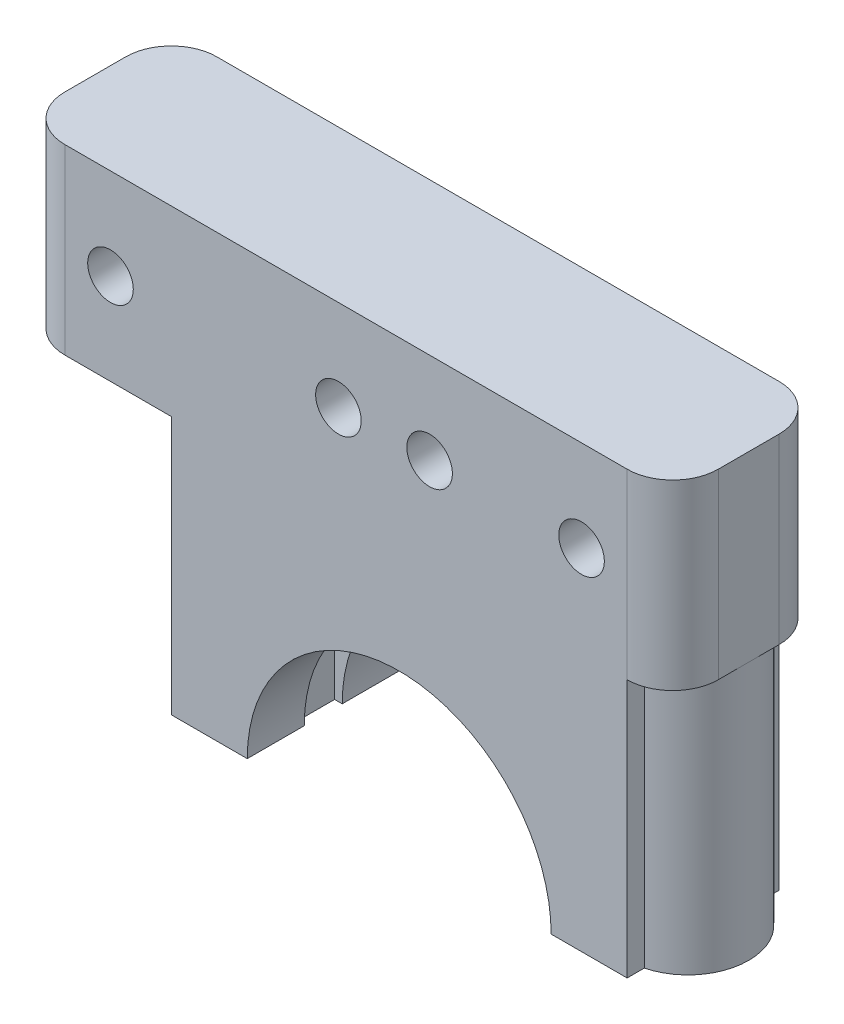
ISO-10303-21;
HEADER;
FILE_DESCRIPTION(('STEP AP214'),'2;1');
FILE_NAME('part.step','',(''),(''),'','','');
FILE_SCHEMA(('AUTOMOTIVE_DESIGN { 1 0 10303 214 1 1 1 1 }'));
ENDSEC;
DATA;
#1=APPLICATION_CONTEXT('core data for automotive mechanical design processes');
#2=APPLICATION_PROTOCOL_DEFINITION('international standard','automotive_design',2000,#1);
#3=PRODUCT_CONTEXT('',#1,'mechanical');
#4=PRODUCT('Part','Part','',(#3));
#5=PRODUCT_RELATED_PRODUCT_CATEGORY('part','',(#4));
#6=PRODUCT_DEFINITION_FORMATION('','',#4);
#7=PRODUCT_DEFINITION_CONTEXT('part definition',#1,'design');
#8=PRODUCT_DEFINITION('design','',#6,#7);
#9=PRODUCT_DEFINITION_SHAPE('','',#8);
#10=(LENGTH_UNIT() NAMED_UNIT(*) SI_UNIT(.MILLI.,.METRE.));
#11=(NAMED_UNIT(*) PLANE_ANGLE_UNIT() SI_UNIT($,.RADIAN.));
#12=(NAMED_UNIT(*) SI_UNIT($,.STERADIAN.) SOLID_ANGLE_UNIT());
#13=UNCERTAINTY_MEASURE_WITH_UNIT(LENGTH_MEASURE(1.E-05),#10,'distance_accuracy_value','');
#14=(GEOMETRIC_REPRESENTATION_CONTEXT(3) GLOBAL_UNCERTAINTY_ASSIGNED_CONTEXT((#13)) GLOBAL_UNIT_ASSIGNED_CONTEXT((#10,
#11,#12)) REPRESENTATION_CONTEXT('',''));
#15=CARTESIAN_POINT('',(0.,0.,0.));
#16=DIRECTION('',(0.,0.,1.));
#17=DIRECTION('',(1.,0.,0.));
#18=AXIS2_PLACEMENT_3D('',#15,#16,#17);
#19=CARTESIAN_POINT('',(-15.,22.8309518948453,0.));
#20=DIRECTION('',(-1.,0.,0.));
#21=DIRECTION('',(0.,0.,1.));
#22=AXIS2_PLACEMENT_3D('',#19,#20,#21);
#23=PLANE('',#22);
#24=DIRECTION('',(0.,-1.,0.));
#25=VECTOR('',#24,1.);
#26=CARTESIAN_POINT('',(-15.,22.8309518948453,1.12701665379258));
#27=LINE('',#26,#25);
#28=CARTESIAN_POINT('',(-15.,17.,1.12701665379258));
#29=VERTEX_POINT('',#28);
#30=CARTESIAN_POINT('',(-15.,0.,1.12701665379258));
#31=VERTEX_POINT('',#30);
#32=EDGE_CURVE('E208',#29,#31,#27,.T.);
#33=ORIENTED_EDGE('',*,*,#32,.F.);
#34=DIRECTION('',(0.,0.,-1.));
#35=VECTOR('',#34,1.);
#36=CARTESIAN_POINT('',(-15.,17.,0.));
#37=LINE('',#36,#35);
#38=CARTESIAN_POINT('',(-15.,17.,0.));
#39=VERTEX_POINT('',#38);
#40=EDGE_CURVE('E193',#29,#39,#37,.T.);
#41=ORIENTED_EDGE('',*,*,#40,.T.);
#42=DIRECTION('',(0.,-1.,0.));
#43=VECTOR('',#42,1.);
#44=CARTESIAN_POINT('',(-15.,22.8309518948453,0.));
#45=LINE('',#44,#43);
#46=CARTESIAN_POINT('',(-15.,0.,0.));
#47=VERTEX_POINT('',#46);
#48=EDGE_CURVE('E206',#39,#47,#45,.T.);
#49=ORIENTED_EDGE('',*,*,#48,.T.);
#50=DIRECTION('',(0.,0.,-1.));
#51=VECTOR('',#50,1.);
#52=CARTESIAN_POINT('',(-15.,0.,0.));
#53=LINE('',#52,#51);
#54=EDGE_CURVE('E273',#31,#47,#53,.T.);
#55=ORIENTED_EDGE('',*,*,#54,.F.);
#56=EDGE_LOOP('',(#33,#41,#49,#55));
#57=FACE_BOUND('',#56,.T.);
#58=ADVANCED_FACE('F34',(#57),#23,.T.);
#59=CARTESIAN_POINT('',(14.,22.8309518948453,5.00000000000001));
#60=DIRECTION('',(0.,-1.,0.));
#61=DIRECTION('',(0.,0.,-1.));
#62=AXIS2_PLACEMENT_3D('',#59,#60,#61);
#63=CYLINDRICAL_SURFACE('',#62,4.);
#64=CARTESIAN_POINT('',(14.,17.,5.00000000000001));
#65=DIRECTION('',(0.,1.,0.));
#66=DIRECTION('',(-1.,0.,0.));
#67=AXIS2_PLACEMENT_3D('',#64,#65,#66);
#68=CIRCLE('',#67,4.);
#69=CARTESIAN_POINT('',(18.,17.,5.00000000000001));
#70=VERTEX_POINT('',#69);
#71=CARTESIAN_POINT('',(15.,17.,1.12701665379259));
#72=VERTEX_POINT('',#71);
#73=EDGE_CURVE('E364',#70,#72,#68,.T.);
#74=ORIENTED_EDGE('',*,*,#73,.F.);
#75=CARTESIAN_POINT('',(15.,17.,8.87298334620743));
#76=VERTEX_POINT('',#75);
#77=EDGE_CURVE('E361',#76,#70,#68,.T.);
#78=ORIENTED_EDGE('',*,*,#77,.F.);
#79=DIRECTION('',(0.,-1.,0.));
#80=VECTOR('',#79,1.);
#81=CARTESIAN_POINT('',(15.,22.8309518948453,8.87298334620743));
#82=LINE('',#81,#80);
#83=CARTESIAN_POINT('',(15.,0.,8.87298334620743));
#84=VERTEX_POINT('',#83);
#85=EDGE_CURVE('E232',#76,#84,#82,.T.);
#86=ORIENTED_EDGE('',*,*,#85,.T.);
#87=CARTESIAN_POINT('',(14.,0.,5.00000000000001));
#88=DIRECTION('',(0.,1.,0.));
#89=DIRECTION('',(0.,0.,1.));
#90=AXIS2_PLACEMENT_3D('',#87,#88,#89);
#91=CIRCLE('',#90,4.);
#92=CARTESIAN_POINT('',(15.,0.,1.12701665379259));
#93=VERTEX_POINT('',#92);
#94=EDGE_CURVE('E292',#84,#93,#91,.T.);
#95=ORIENTED_EDGE('',*,*,#94,.T.);
#96=DIRECTION('',(0.,-1.,0.));
#97=VECTOR('',#96,1.);
#98=CARTESIAN_POINT('',(15.,22.8309518948453,1.12701665379259));
#99=LINE('',#98,#97);
#100=EDGE_CURVE('E222',#72,#93,#99,.T.);
#101=ORIENTED_EDGE('',*,*,#100,.F.);
#102=EDGE_LOOP('',(#74,#78,#86,#95,#101));
#103=FACE_BOUND('',#102,.T.);
#104=ADVANCED_FACE('F438',(#103),#63,.T.);
#105=CARTESIAN_POINT('',(15.,22.8309518948453,0.));
#106=DIRECTION('',(-1.,0.,0.));
#107=DIRECTION('',(0.,0.,1.));
#108=AXIS2_PLACEMENT_3D('',#105,#106,#107);
#109=PLANE('',#108);
#110=DIRECTION('',(0.,0.,-1.));
#111=VECTOR('',#110,1.);
#112=CARTESIAN_POINT('',(15.,17.,0.));
#113=LINE('',#112,#111);
#114=CARTESIAN_POINT('',(15.,17.,0.));
#115=VERTEX_POINT('',#114);
#116=EDGE_CURVE('E365',#72,#115,#113,.T.);
#117=ORIENTED_EDGE('',*,*,#116,.F.);
#118=ORIENTED_EDGE('',*,*,#100,.T.);
#119=DIRECTION('',(0.,0.,-1.));
#120=VECTOR('',#119,1.);
#121=CARTESIAN_POINT('',(15.,0.,0.));
#122=LINE('',#121,#120);
#123=CARTESIAN_POINT('',(15.,0.,0.));
#124=VERTEX_POINT('',#123);
#125=EDGE_CURVE('E264',#93,#124,#122,.T.);
#126=ORIENTED_EDGE('',*,*,#125,.T.);
#127=DIRECTION('',(0.,-1.,0.));
#128=VECTOR('',#127,1.);
#129=CARTESIAN_POINT('',(15.,22.8309518948453,0.));
#130=LINE('',#129,#128);
#131=EDGE_CURVE('E218',#115,#124,#130,.T.);
#132=ORIENTED_EDGE('',*,*,#131,.F.);
#133=EDGE_LOOP('',(#117,#118,#126,#132));
#134=FACE_BOUND('',#133,.T.);
#135=ADVANCED_FACE('F443',(#134),#109,.F.);
#136=CARTESIAN_POINT('',(-14.,22.8309518948453,5.));
#137=DIRECTION('',(0.,-1.,0.));
#138=DIRECTION('',(0.,0.,-1.));
#139=AXIS2_PLACEMENT_3D('',#136,#137,#138);
#140=CYLINDRICAL_SURFACE('',#139,4.);
#141=DIRECTION('',(0.,-1.,0.));
#142=VECTOR('',#141,1.);
#143=CARTESIAN_POINT('',(-15.,22.8309518948453,8.87298334620742));
#144=LINE('',#143,#142);
#145=CARTESIAN_POINT('',(-15.,17.,8.87298334620742));
#146=VERTEX_POINT('',#145);
#147=CARTESIAN_POINT('',(-15.,0.,8.87298334620742));
#148=VERTEX_POINT('',#147);
#149=EDGE_CURVE('E401',#146,#148,#144,.T.);
#150=ORIENTED_EDGE('',*,*,#149,.F.);
#151=CARTESIAN_POINT('',(-14.,17.,5.));
#152=DIRECTION('',(0.,1.,0.));
#153=DIRECTION('',(-1.,0.,0.));
#154=AXIS2_PLACEMENT_3D('',#151,#152,#153);
#155=CIRCLE('',#154,4.);
#156=EDGE_CURVE('E210',#146,#29,#155,.F.);
#157=ORIENTED_EDGE('',*,*,#156,.T.);
#158=ORIENTED_EDGE('',*,*,#32,.T.);
#159=CARTESIAN_POINT('',(-14.,0.,5.));
#160=DIRECTION('',(0.,1.,0.));
#161=DIRECTION('',(0.,0.,1.));
#162=AXIS2_PLACEMENT_3D('',#159,#160,#161);
#163=CIRCLE('',#162,4.);
#164=EDGE_CURVE('E279',#148,#31,#163,.F.);
#165=ORIENTED_EDGE('',*,*,#164,.F.);
#166=EDGE_LOOP('',(#150,#157,#158,#165));
#167=FACE_BOUND('',#166,.T.);
#168=ADVANCED_FACE('F416',(#167),#140,.T.);
#169=CARTESIAN_POINT('',(-15.,22.8309518948453,0.));
#170=DIRECTION('',(-1.,0.,0.));
#171=DIRECTION('',(0.,0.,1.));
#172=AXIS2_PLACEMENT_3D('',#169,#170,#171);
#173=PLANE('',#172);
#174=DIRECTION('',(0.,-1.,0.));
#175=VECTOR('',#174,1.);
#176=CARTESIAN_POINT('',(-15.,22.8309518948453,10.));
#177=LINE('',#176,#175);
#178=CARTESIAN_POINT('',(-15.,17.,10.));
#179=VERTEX_POINT('',#178);
#180=CARTESIAN_POINT('',(-15.,0.,10.));
#181=VERTEX_POINT('',#180);
#182=EDGE_CURVE('E408',#179,#181,#177,.T.);
#183=ORIENTED_EDGE('',*,*,#182,.F.);
#184=DIRECTION('',(0.,0.,-1.));
#185=VECTOR('',#184,1.);
#186=CARTESIAN_POINT('',(-15.,17.,0.));
#187=LINE('',#186,#185);
#188=EDGE_CURVE('E368',#179,#146,#187,.T.);
#189=ORIENTED_EDGE('',*,*,#188,.T.);
#190=ORIENTED_EDGE('',*,*,#149,.T.);
#191=DIRECTION('',(0.,0.,-1.));
#192=VECTOR('',#191,1.);
#193=CARTESIAN_POINT('',(-15.,0.,0.));
#194=LINE('',#193,#192);
#195=EDGE_CURVE('E274',#181,#148,#194,.T.);
#196=ORIENTED_EDGE('',*,*,#195,.F.);
#197=EDGE_LOOP('',(#183,#189,#190,#196));
#198=FACE_BOUND('',#197,.T.);
#199=ADVANCED_FACE('F414',(#198),#173,.T.);
#200=CARTESIAN_POINT('',(15.,22.8309518948453,0.));
#201=DIRECTION('',(-1.,0.,0.));
#202=DIRECTION('',(0.,0.,1.));
#203=AXIS2_PLACEMENT_3D('',#200,#201,#202);
#204=PLANE('',#203);
#205=DIRECTION('',(0.,0.,-1.));
#206=VECTOR('',#205,1.);
#207=CARTESIAN_POINT('',(15.,17.,0.));
#208=LINE('',#207,#206);
#209=CARTESIAN_POINT('',(15.,17.,10.));
#210=VERTEX_POINT('',#209);
#211=EDGE_CURVE('E302',#210,#76,#208,.T.);
#212=ORIENTED_EDGE('',*,*,#211,.F.);
#213=DIRECTION('',(0.,-1.,0.));
#214=VECTOR('',#213,1.);
#215=CARTESIAN_POINT('',(15.,22.8309518948453,10.));
#216=LINE('',#215,#214);
#217=CARTESIAN_POINT('',(15.,0.,10.));
#218=VERTEX_POINT('',#217);
#219=EDGE_CURVE('E220',#210,#218,#216,.T.);
#220=ORIENTED_EDGE('',*,*,#219,.T.);
#221=DIRECTION('',(0.,0.,-1.));
#222=VECTOR('',#221,1.);
#223=CARTESIAN_POINT('',(15.,0.,0.));
#224=LINE('',#223,#222);
#225=EDGE_CURVE('E295',#218,#84,#224,.T.);
#226=ORIENTED_EDGE('',*,*,#225,.T.);
#227=ORIENTED_EDGE('',*,*,#85,.F.);
#228=EDGE_LOOP('',(#212,#220,#226,#227));
#229=FACE_BOUND('',#228,.T.);
#230=ADVANCED_FACE('F454',(#229),#204,.F.);
#231=CARTESIAN_POINT('',(0.,0.,0.));
#232=DIRECTION('',(0.,1.,0.));
#233=DIRECTION('',(0.,0.,1.));
#234=AXIS2_PLACEMENT_3D('',#231,#232,#233);
#235=PLANE('',#234);
#236=CARTESIAN_POINT('',(14.,0.,5.00000000000001));
#237=DIRECTION('',(0.,1.,0.));
#238=DIRECTION('',(0.,0.,1.));
#239=AXIS2_PLACEMENT_3D('',#236,#237,#238);
#240=CIRCLE('',#239,2.);
#241=CARTESIAN_POINT('',(14.,0.,7.00000000000001));
#242=VERTEX_POINT('',#241);
#243=EDGE_CURVE('E278',#242,#242,#240,.T.);
#244=ORIENTED_EDGE('',*,*,#243,.T.);
#245=EDGE_LOOP('',(#244));
#246=FACE_BOUND('',#245,.T.);
#247=DIRECTION('',(1.,0.,0.));
#248=VECTOR('',#247,1.);
#249=CARTESIAN_POINT('',(0.,0.,6.25));
#250=LINE('',#249,#248);
#251=CARTESIAN_POINT('',(10.,0.,6.25));
#252=VERTEX_POINT('',#251);
#253=CARTESIAN_POINT('',(10.5,0.,6.25));
#254=VERTEX_POINT('',#253);
#255=EDGE_CURVE('E393',#252,#254,#250,.T.);
#256=ORIENTED_EDGE('',*,*,#255,.T.);
#257=DIRECTION('',(0.,0.,-1.));
#258=VECTOR('',#257,1.);
#259=CARTESIAN_POINT('',(10.5,0.,0.));
#260=LINE('',#259,#258);
#261=CARTESIAN_POINT('',(10.5,0.,3.75));
#262=VERTEX_POINT('',#261);
#263=EDGE_CURVE('E277',#254,#262,#260,.T.);
#264=ORIENTED_EDGE('',*,*,#263,.T.);
#265=DIRECTION('',(1.,0.,0.));
#266=VECTOR('',#265,1.);
#267=CARTESIAN_POINT('',(0.,0.,3.75));
#268=LINE('',#267,#266);
#269=CARTESIAN_POINT('',(10.,0.,3.75));
#270=VERTEX_POINT('',#269);
#271=EDGE_CURVE('E387',#270,#262,#268,.T.);
#272=ORIENTED_EDGE('',*,*,#271,.F.);
#273=DIRECTION('',(0.,0.,-1.));
#274=VECTOR('',#273,1.);
#275=CARTESIAN_POINT('',(10.,0.,10.));
#276=LINE('',#275,#274);
#277=CARTESIAN_POINT('',(10.,0.,0.));
#278=VERTEX_POINT('',#277);
#279=EDGE_CURVE('E286',#270,#278,#276,.T.);
#280=ORIENTED_EDGE('',*,*,#279,.T.);
#281=DIRECTION('',(-1.,0.,0.));
#282=VECTOR('',#281,1.);
#283=CARTESIAN_POINT('',(0.,0.,0.));
#284=LINE('',#283,#282);
#285=EDGE_CURVE('E283',#124,#278,#284,.T.);
#286=ORIENTED_EDGE('',*,*,#285,.F.);
#287=ORIENTED_EDGE('',*,*,#125,.F.);
#288=ORIENTED_EDGE('',*,*,#94,.F.);
#289=ORIENTED_EDGE('',*,*,#225,.F.);
#290=DIRECTION('',(-1.,0.,0.));
#291=VECTOR('',#290,1.);
#292=CARTESIAN_POINT('',(0.,0.,10.));
#293=LINE('',#292,#291);
#294=CARTESIAN_POINT('',(10.,0.,10.));
#295=VERTEX_POINT('',#294);
#296=EDGE_CURVE('E268',#218,#295,#293,.T.);
#297=ORIENTED_EDGE('',*,*,#296,.T.);
#298=EDGE_CURVE('E285',#295,#252,#276,.T.);
#299=ORIENTED_EDGE('',*,*,#298,.T.);
#300=EDGE_LOOP('',(#256,#264,#272,#280,#286,#287,#288,#289,#297,#299));
#301=FACE_BOUND('',#300,.T.);
#302=ADVANCED_FACE('F456',(#246,#301),#235,.F.);
#303=DIRECTION('',(0.,0.,-1.));
#304=VECTOR('',#303,1.);
#305=CARTESIAN_POINT('',(-10.,0.,10.));
#306=LINE('',#305,#304);
#307=CARTESIAN_POINT('',(-10.,0.,0.));
#308=VERTEX_POINT('',#307);
#309=CARTESIAN_POINT('',(-10.,0.,3.75));
#310=VERTEX_POINT('',#309);
#311=EDGE_CURVE('E269',#308,#310,#306,.F.);
#312=ORIENTED_EDGE('',*,*,#311,.T.);
#313=CARTESIAN_POINT('',(-10.5,0.,3.75));
#314=VERTEX_POINT('',#313);
#315=EDGE_CURVE('E388',#314,#310,#268,.T.);
#316=ORIENTED_EDGE('',*,*,#315,.F.);
#317=DIRECTION('',(0.,0.,1.));
#318=VECTOR('',#317,1.);
#319=CARTESIAN_POINT('',(-10.5,0.,0.));
#320=LINE('',#319,#318);
#321=CARTESIAN_POINT('',(-10.5,0.,6.25));
#322=VERTEX_POINT('',#321);
#323=EDGE_CURVE('E305',#314,#322,#320,.T.);
#324=ORIENTED_EDGE('',*,*,#323,.T.);
#325=CARTESIAN_POINT('',(-10.,0.,6.25));
#326=VERTEX_POINT('',#325);
#327=EDGE_CURVE('E396',#322,#326,#250,.T.);
#328=ORIENTED_EDGE('',*,*,#327,.T.);
#329=CARTESIAN_POINT('',(-10.,0.,10.));
#330=VERTEX_POINT('',#329);
#331=EDGE_CURVE('E265',#326,#330,#306,.F.);
#332=ORIENTED_EDGE('',*,*,#331,.T.);
#333=EDGE_CURVE('E270',#330,#181,#293,.T.);
#334=ORIENTED_EDGE('',*,*,#333,.T.);
#335=ORIENTED_EDGE('',*,*,#195,.T.);
#336=ORIENTED_EDGE('',*,*,#164,.T.);
#337=ORIENTED_EDGE('',*,*,#54,.T.);
#338=EDGE_CURVE('E216',#308,#47,#284,.T.);
#339=ORIENTED_EDGE('',*,*,#338,.F.);
#340=EDGE_LOOP('',(#312,#316,#324,#328,#332,#334,#335,#336,#337,#339));
#341=FACE_BOUND('',#340,.T.);
#342=CARTESIAN_POINT('',(-14.,0.,5.));
#343=DIRECTION('',(0.,1.,0.));
#344=DIRECTION('',(0.,0.,1.));
#345=AXIS2_PLACEMENT_3D('',#342,#343,#344);
#346=CIRCLE('',#345,2.);
#347=CARTESIAN_POINT('',(-14.,0.,7.));
#348=VERTEX_POINT('',#347);
#349=EDGE_CURVE('E291',#348,#348,#346,.F.);
#350=ORIENTED_EDGE('',*,*,#349,.F.);
#351=EDGE_LOOP('',(#350));
#352=FACE_BOUND('',#351,.T.);
#353=ADVANCED_FACE('F419',(#341,#352),#235,.F.);
#354=CARTESIAN_POINT('',(-4.00000000000001,23.,10.));
#355=DIRECTION('',(0.,0.,-1.));
#356=DIRECTION('',(-1.,0.,0.));
#357=AXIS2_PLACEMENT_3D('',#354,#355,#356);
#358=CYLINDRICAL_SURFACE('',#357,1.5);
#359=CARTESIAN_POINT('',(-4.00000000000001,23.,10.));
#360=DIRECTION('',(0.,0.,1.));
#361=DIRECTION('',(1.,0.,0.));
#362=AXIS2_PLACEMENT_3D('',#359,#360,#361);
#363=CIRCLE('',#362,1.5);
#364=CARTESIAN_POINT('',(-2.5,23.,10.));
#365=VERTEX_POINT('',#364);
#366=EDGE_CURVE('E236',#365,#365,#363,.T.);
#367=ORIENTED_EDGE('',*,*,#366,.T.);
#368=EDGE_LOOP('',(#367));
#369=FACE_BOUND('',#368,.T.);
#370=CARTESIAN_POINT('',(-4.00000000000001,23.,0.));
#371=DIRECTION('',(0.,0.,1.));
#372=DIRECTION('',(1.,0.,0.));
#373=AXIS2_PLACEMENT_3D('',#370,#371,#372);
#374=CIRCLE('',#373,1.5);
#375=CARTESIAN_POINT('',(-2.5,23.,0.));
#376=VERTEX_POINT('',#375);
#377=EDGE_CURVE('E229',#376,#376,#374,.T.);
#378=ORIENTED_EDGE('',*,*,#377,.F.);
#379=EDGE_LOOP('',(#378));
#380=FACE_BOUND('',#379,.T.);
#381=ADVANCED_FACE('F485',(#369,#380),#358,.F.);
#382=CARTESIAN_POINT('',(1.99999999999999,23.,10.));
#383=DIRECTION('',(0.,0.,-1.));
#384=DIRECTION('',(-1.,0.,0.));
#385=AXIS2_PLACEMENT_3D('',#382,#383,#384);
#386=CYLINDRICAL_SURFACE('',#385,1.5);
#387=CARTESIAN_POINT('',(1.99999999999999,23.,10.));
#388=DIRECTION('',(0.,0.,1.));
#389=DIRECTION('',(1.,0.,0.));
#390=AXIS2_PLACEMENT_3D('',#387,#388,#389);
#391=CIRCLE('',#390,1.5);
#392=CARTESIAN_POINT('',(3.5,23.,10.));
#393=VERTEX_POINT('',#392);
#394=EDGE_CURVE('E239',#393,#393,#391,.T.);
#395=ORIENTED_EDGE('',*,*,#394,.T.);
#396=EDGE_LOOP('',(#395));
#397=FACE_BOUND('',#396,.T.);
#398=CARTESIAN_POINT('',(1.99999999999999,23.,0.));
#399=DIRECTION('',(0.,0.,1.));
#400=DIRECTION('',(1.,0.,0.));
#401=AXIS2_PLACEMENT_3D('',#398,#399,#400);
#402=CIRCLE('',#401,1.5);
#403=CARTESIAN_POINT('',(3.5,23.,0.));
#404=VERTEX_POINT('',#403);
#405=EDGE_CURVE('E252',#404,#404,#402,.T.);
#406=ORIENTED_EDGE('',*,*,#405,.F.);
#407=EDGE_LOOP('',(#406));
#408=FACE_BOUND('',#407,.T.);
#409=ADVANCED_FACE('F481',(#397,#408),#386,.F.);
#410=CARTESIAN_POINT('',(12.,23.,10.));
#411=DIRECTION('',(0.,0.,-1.));
#412=DIRECTION('',(-1.,0.,0.));
#413=AXIS2_PLACEMENT_3D('',#410,#411,#412);
#414=CYLINDRICAL_SURFACE('',#413,1.5);
#415=CARTESIAN_POINT('',(12.,23.,10.));
#416=DIRECTION('',(0.,0.,1.));
#417=DIRECTION('',(1.,0.,0.));
#418=AXIS2_PLACEMENT_3D('',#415,#416,#417);
#419=CIRCLE('',#418,1.5);
#420=CARTESIAN_POINT('',(13.5,23.,10.));
#421=VERTEX_POINT('',#420);
#422=EDGE_CURVE('E243',#421,#421,#419,.T.);
#423=ORIENTED_EDGE('',*,*,#422,.T.);
#424=EDGE_LOOP('',(#423));
#425=FACE_BOUND('',#424,.T.);
#426=CARTESIAN_POINT('',(12.,23.,0.));
#427=DIRECTION('',(0.,0.,1.));
#428=DIRECTION('',(1.,0.,0.));
#429=AXIS2_PLACEMENT_3D('',#426,#427,#428);
#430=CIRCLE('',#429,1.5);
#431=CARTESIAN_POINT('',(13.5,23.,0.));
#432=VERTEX_POINT('',#431);
#433=EDGE_CURVE('E255',#432,#432,#430,.T.);
#434=ORIENTED_EDGE('',*,*,#433,.F.);
#435=EDGE_LOOP('',(#434));
#436=FACE_BOUND('',#435,.T.);
#437=ADVANCED_FACE('F476',(#425,#436),#414,.F.);
#438=CARTESIAN_POINT('',(0.,0.,10.));
#439=DIRECTION('',(0.,0.,-1.));
#440=DIRECTION('',(-1.,0.,0.));
#441=AXIS2_PLACEMENT_3D('',#438,#439,#440);
#442=CYLINDRICAL_SURFACE('',#441,10.);
#443=ORIENTED_EDGE('',*,*,#279,.F.);
#444=CARTESIAN_POINT('',(0.,0.,3.75));
#445=DIRECTION('',(0.,0.,1.));
#446=DIRECTION('',(1.,0.,0.));
#447=AXIS2_PLACEMENT_3D('',#444,#445,#446);
#448=CIRCLE('',#447,10.);
#449=EDGE_CURVE('E261',#270,#310,#448,.T.);
#450=ORIENTED_EDGE('',*,*,#449,.T.);
#451=ORIENTED_EDGE('',*,*,#311,.F.);
#452=CARTESIAN_POINT('',(0.,0.,0.));
#453=DIRECTION('',(0.,0.,1.));
#454=DIRECTION('',(1.,0.,0.));
#455=AXIS2_PLACEMENT_3D('',#452,#453,#454);
#456=CIRCLE('',#455,10.);
#457=EDGE_CURVE('E240',#278,#308,#456,.T.);
#458=ORIENTED_EDGE('',*,*,#457,.F.);
#459=EDGE_LOOP('',(#443,#450,#451,#458));
#460=FACE_BOUND('',#459,.T.);
#461=ADVANCED_FACE('F472',(#460),#442,.F.);
#462=CARTESIAN_POINT('',(0.,0.,3.75));
#463=DIRECTION('',(0.,0.,1.));
#464=DIRECTION('',(1.,0.,0.));
#465=AXIS2_PLACEMENT_3D('',#462,#463,#464);
#466=PLANE('',#465);
#467=ORIENTED_EDGE('',*,*,#271,.T.);
#468=DIRECTION('',(0.,1.,0.));
#469=VECTOR('',#468,1.);
#470=CARTESIAN_POINT('',(10.5,0.,3.75));
#471=LINE('',#470,#469);
#472=CARTESIAN_POINT('',(10.5,11.,3.75));
#473=VERTEX_POINT('',#472);
#474=EDGE_CURVE('E399',#262,#473,#471,.T.);
#475=ORIENTED_EDGE('',*,*,#474,.T.);
#476=DIRECTION('',(-1.,0.,0.));
#477=VECTOR('',#476,1.);
#478=CARTESIAN_POINT('',(0.,11.,3.75));
#479=LINE('',#478,#477);
#480=CARTESIAN_POINT('',(-10.5,11.,3.75));
#481=VERTEX_POINT('',#480);
#482=EDGE_CURVE('E384',#473,#481,#479,.T.);
#483=ORIENTED_EDGE('',*,*,#482,.T.);
#484=DIRECTION('',(0.,1.,0.));
#485=VECTOR('',#484,1.);
#486=CARTESIAN_POINT('',(-10.5,0.,3.75));
#487=LINE('',#486,#485);
#488=EDGE_CURVE('E390',#314,#481,#487,.T.);
#489=ORIENTED_EDGE('',*,*,#488,.F.);
#490=ORIENTED_EDGE('',*,*,#315,.T.);
#491=ORIENTED_EDGE('',*,*,#449,.F.);
#492=EDGE_LOOP('',(#467,#475,#483,#489,#490,#491));
#493=FACE_BOUND('',#492,.T.);
#494=ADVANCED_FACE('F475',(#493),#466,.T.);
#495=CARTESIAN_POINT('',(10.5,0.,0.));
#496=DIRECTION('',(1.,0.,0.));
#497=DIRECTION('',(0.,0.,-1.));
#498=AXIS2_PLACEMENT_3D('',#495,#496,#497);
#499=PLANE('',#498);
#500=DIRECTION('',(0.,1.,0.));
#501=VECTOR('',#500,1.);
#502=CARTESIAN_POINT('',(10.5,0.,6.25));
#503=LINE('',#502,#501);
#504=CARTESIAN_POINT('',(10.5,11.,6.25));
#505=VERTEX_POINT('',#504);
#506=EDGE_CURVE('E402',#254,#505,#503,.T.);
#507=ORIENTED_EDGE('',*,*,#506,.T.);
#508=DIRECTION('',(0.,0.,1.));
#509=VECTOR('',#508,1.);
#510=CARTESIAN_POINT('',(10.5,11.,0.));
#511=LINE('',#510,#509);
#512=EDGE_CURVE('E374',#473,#505,#511,.T.);
#513=ORIENTED_EDGE('',*,*,#512,.F.);
#514=ORIENTED_EDGE('',*,*,#474,.F.);
#515=ORIENTED_EDGE('',*,*,#263,.F.);
#516=EDGE_LOOP('',(#507,#513,#514,#515));
#517=FACE_BOUND('',#516,.T.);
#518=ADVANCED_FACE('F829',(#517),#499,.F.);
#519=CARTESIAN_POINT('',(0.,11.,0.));
#520=DIRECTION('',(0.,-1.,0.));
#521=DIRECTION('',(0.,0.,-1.));
#522=AXIS2_PLACEMENT_3D('',#519,#520,#521);
#523=PLANE('',#522);
#524=ORIENTED_EDGE('',*,*,#512,.T.);
#525=DIRECTION('',(-1.,0.,0.));
#526=VECTOR('',#525,1.);
#527=CARTESIAN_POINT('',(0.,11.,6.25));
#528=LINE('',#527,#526);
#529=CARTESIAN_POINT('',(-10.5,11.,6.25));
#530=VERTEX_POINT('',#529);
#531=EDGE_CURVE('E378',#505,#530,#528,.T.);
#532=ORIENTED_EDGE('',*,*,#531,.T.);
#533=DIRECTION('',(0.,0.,-1.));
#534=VECTOR('',#533,1.);
#535=CARTESIAN_POINT('',(-10.5,11.,0.));
#536=LINE('',#535,#534);
#537=EDGE_CURVE('E381',#530,#481,#536,.T.);
#538=ORIENTED_EDGE('',*,*,#537,.T.);
#539=ORIENTED_EDGE('',*,*,#482,.F.);
#540=EDGE_LOOP('',(#524,#532,#538,#539));
#541=FACE_BOUND('',#540,.T.);
#542=ADVANCED_FACE('F825',(#541),#523,.T.);
#543=CARTESIAN_POINT('',(-10.5,0.,0.));
#544=DIRECTION('',(-1.,0.,0.));
#545=DIRECTION('',(0.,0.,1.));
#546=AXIS2_PLACEMENT_3D('',#543,#544,#545);
#547=PLANE('',#546);
#548=ORIENTED_EDGE('',*,*,#488,.T.);
#549=ORIENTED_EDGE('',*,*,#537,.F.);
#550=DIRECTION('',(0.,1.,0.));
#551=VECTOR('',#550,1.);
#552=CARTESIAN_POINT('',(-10.5,0.,6.25));
#553=LINE('',#552,#551);
#554=EDGE_CURVE('E404',#322,#530,#553,.T.);
#555=ORIENTED_EDGE('',*,*,#554,.F.);
#556=ORIENTED_EDGE('',*,*,#323,.F.);
#557=EDGE_LOOP('',(#548,#549,#555,#556));
#558=FACE_BOUND('',#557,.T.);
#559=ADVANCED_FACE('F533',(#558),#547,.F.);
#560=ORIENTED_EDGE('',*,*,#298,.F.);
#561=CARTESIAN_POINT('',(0.,0.,10.));
#562=DIRECTION('',(0.,0.,1.));
#563=DIRECTION('',(1.,0.,0.));
#564=AXIS2_PLACEMENT_3D('',#561,#562,#563);
#565=CIRCLE('',#564,10.);
#566=EDGE_CURVE('E246',#295,#330,#565,.T.);
#567=ORIENTED_EDGE('',*,*,#566,.T.);
#568=ORIENTED_EDGE('',*,*,#331,.F.);
#569=CARTESIAN_POINT('',(0.,0.,6.25));
#570=DIRECTION('',(0.,0.,1.));
#571=DIRECTION('',(1.,0.,0.));
#572=AXIS2_PLACEMENT_3D('',#569,#570,#571);
#573=CIRCLE('',#572,10.);
#574=EDGE_CURVE('E249',#252,#326,#573,.T.);
#575=ORIENTED_EDGE('',*,*,#574,.F.);
#576=EDGE_LOOP('',(#560,#567,#568,#575));
#577=FACE_BOUND('',#576,.T.);
#578=ADVANCED_FACE('F478',(#577),#442,.F.);
#579=CARTESIAN_POINT('',(0.,0.,6.25));
#580=DIRECTION('',(0.,0.,1.));
#581=DIRECTION('',(1.,0.,0.));
#582=AXIS2_PLACEMENT_3D('',#579,#580,#581);
#583=PLANE('',#582);
#584=ORIENTED_EDGE('',*,*,#255,.F.);
#585=ORIENTED_EDGE('',*,*,#574,.T.);
#586=ORIENTED_EDGE('',*,*,#327,.F.);
#587=ORIENTED_EDGE('',*,*,#554,.T.);
#588=ORIENTED_EDGE('',*,*,#531,.F.);
#589=ORIENTED_EDGE('',*,*,#506,.F.);
#590=EDGE_LOOP('',(#584,#585,#586,#587,#588,#589));
#591=FACE_BOUND('',#590,.T.);
#592=ADVANCED_FACE('F471',(#591),#583,.F.);
#593=CARTESIAN_POINT('',(0.,0.,0.));
#594=DIRECTION('',(0.,0.,1.));
#595=DIRECTION('',(1.,0.,0.));
#596=AXIS2_PLACEMENT_3D('',#593,#594,#595);
#597=PLANE('',#596);
#598=DIRECTION('',(1.,0.,0.));
#599=VECTOR('',#598,1.);
#600=CARTESIAN_POINT('',(18.,29.,0.));
#601=LINE('',#600,#599);
#602=CARTESIAN_POINT('',(-22.,29.,0.));
#603=VERTEX_POINT('',#602);
#604=CARTESIAN_POINT('',(15.,29.,0.));
#605=VERTEX_POINT('',#604);
#606=EDGE_CURVE('E372',#603,#605,#601,.T.);
#607=ORIENTED_EDGE('',*,*,#606,.T.);
#608=DIRECTION('',(0.,1.,0.));
#609=VECTOR('',#608,1.);
#610=CARTESIAN_POINT('',(15.,0.,0.));
#611=LINE('',#610,#609);
#612=EDGE_CURVE('E321',#605,#115,#611,.F.);
#613=ORIENTED_EDGE('',*,*,#612,.T.);
#614=ORIENTED_EDGE('',*,*,#131,.T.);
#615=ORIENTED_EDGE('',*,*,#285,.T.);
#616=ORIENTED_EDGE('',*,*,#457,.T.);
#617=ORIENTED_EDGE('',*,*,#338,.T.);
#618=ORIENTED_EDGE('',*,*,#48,.F.);
#619=DIRECTION('',(1.,0.,0.));
#620=VECTOR('',#619,1.);
#621=CARTESIAN_POINT('',(18.,17.,0.));
#622=LINE('',#621,#620);
#623=CARTESIAN_POINT('',(-22.,17.,0.));
#624=VERTEX_POINT('',#623);
#625=EDGE_CURVE('E190',#624,#39,#622,.T.);
#626=ORIENTED_EDGE('',*,*,#625,.F.);
#627=DIRECTION('',(0.,1.,0.));
#628=VECTOR('',#627,1.);
#629=CARTESIAN_POINT('',(-22.,0.,0.));
#630=LINE('',#629,#628);
#631=EDGE_CURVE('E319',#624,#603,#630,.T.);
#632=ORIENTED_EDGE('',*,*,#631,.T.);
#633=EDGE_LOOP('',(#607,#613,#614,#615,#616,#617,#618,#626,#632));
#634=FACE_BOUND('',#633,.T.);
#635=ORIENTED_EDGE('',*,*,#377,.T.);
#636=EDGE_LOOP('',(#635));
#637=FACE_BOUND('',#636,.T.);
#638=ORIENTED_EDGE('',*,*,#405,.T.);
#639=EDGE_LOOP('',(#638));
#640=FACE_BOUND('',#639,.T.);
#641=ORIENTED_EDGE('',*,*,#433,.T.);
#642=EDGE_LOOP('',(#641));
#643=FACE_BOUND('',#642,.T.);
#644=CARTESIAN_POINT('',(-19.,23.,0.));
#645=DIRECTION('',(0.,0.,1.));
#646=DIRECTION('',(1.,0.,0.));
#647=AXIS2_PLACEMENT_3D('',#644,#645,#646);
#648=CIRCLE('',#647,1.5);
#649=CARTESIAN_POINT('',(-17.5,23.,0.));
#650=VERTEX_POINT('',#649);
#651=EDGE_CURVE('E353',#650,#650,#648,.T.);
#652=ORIENTED_EDGE('',*,*,#651,.T.);
#653=EDGE_LOOP('',(#652));
#654=FACE_BOUND('',#653,.T.);
#655=ADVANCED_FACE('F213',(#634,#637,#640,#643,#654),#597,.F.);
#656=CARTESIAN_POINT('',(0.,0.,10.));
#657=DIRECTION('',(0.,0.,1.));
#658=DIRECTION('',(1.,0.,0.));
#659=AXIS2_PLACEMENT_3D('',#656,#657,#658);
#660=PLANE('',#659);
#661=ORIENTED_EDGE('',*,*,#219,.F.);
#662=DIRECTION('',(0.,-1.,0.));
#663=VECTOR('',#662,1.);
#664=CARTESIAN_POINT('',(15.,29.,10.));
#665=LINE('',#664,#663);
#666=CARTESIAN_POINT('',(15.,29.,10.));
#667=VERTEX_POINT('',#666);
#668=EDGE_CURVE('E329',#210,#667,#665,.F.);
#669=ORIENTED_EDGE('',*,*,#668,.T.);
#670=DIRECTION('',(1.,0.,0.));
#671=VECTOR('',#670,1.);
#672=CARTESIAN_POINT('',(18.,29.,10.));
#673=LINE('',#672,#671);
#674=CARTESIAN_POINT('',(-22.,29.,10.));
#675=VERTEX_POINT('',#674);
#676=EDGE_CURVE('E209',#675,#667,#673,.T.);
#677=ORIENTED_EDGE('',*,*,#676,.F.);
#678=DIRECTION('',(0.,1.,0.));
#679=VECTOR('',#678,1.);
#680=CARTESIAN_POINT('',(-22.,17.,10.));
#681=LINE('',#680,#679);
#682=CARTESIAN_POINT('',(-22.,17.,10.));
#683=VERTEX_POINT('',#682);
#684=EDGE_CURVE('E327',#675,#683,#681,.F.);
#685=ORIENTED_EDGE('',*,*,#684,.T.);
#686=DIRECTION('',(-1.,0.,0.));
#687=VECTOR('',#686,1.);
#688=CARTESIAN_POINT('',(18.,17.,10.));
#689=LINE('',#688,#687);
#690=EDGE_CURVE('E352',#179,#683,#689,.T.);
#691=ORIENTED_EDGE('',*,*,#690,.F.);
#692=ORIENTED_EDGE('',*,*,#182,.T.);
#693=ORIENTED_EDGE('',*,*,#333,.F.);
#694=ORIENTED_EDGE('',*,*,#566,.F.);
#695=ORIENTED_EDGE('',*,*,#296,.F.);
#696=EDGE_LOOP('',(#661,#669,#677,#685,#691,#692,#693,#694,#695));
#697=FACE_BOUND('',#696,.T.);
#698=CARTESIAN_POINT('',(-19.,23.,10.));
#699=DIRECTION('',(0.,0.,1.));
#700=DIRECTION('',(1.,0.,0.));
#701=AXIS2_PLACEMENT_3D('',#698,#699,#700);
#702=CIRCLE('',#701,1.5);
#703=CARTESIAN_POINT('',(-17.5,23.,10.));
#704=VERTEX_POINT('',#703);
#705=EDGE_CURVE('E346',#704,#704,#702,.F.);
#706=ORIENTED_EDGE('',*,*,#705,.T.);
#707=EDGE_LOOP('',(#706));
#708=FACE_BOUND('',#707,.T.);
#709=ORIENTED_EDGE('',*,*,#366,.F.);
#710=EDGE_LOOP('',(#709));
#711=FACE_BOUND('',#710,.T.);
#712=ORIENTED_EDGE('',*,*,#394,.F.);
#713=EDGE_LOOP('',(#712));
#714=FACE_BOUND('',#713,.T.);
#715=ORIENTED_EDGE('',*,*,#422,.F.);
#716=EDGE_LOOP('',(#715));
#717=FACE_BOUND('',#716,.T.);
#718=ADVANCED_FACE('F425',(#697,#708,#711,#714,#717),#660,.T.);
#719=CARTESIAN_POINT('',(-14.,22.8309518948453,5.));
#720=DIRECTION('',(0.,-1.,0.));
#721=DIRECTION('',(0.,0.,-1.));
#722=AXIS2_PLACEMENT_3D('',#719,#720,#721);
#723=CYLINDRICAL_SURFACE('',#722,2.);
#724=ORIENTED_EDGE('',*,*,#349,.T.);
#725=EDGE_LOOP('',(#724));
#726=FACE_BOUND('',#725,.T.);
#727=CARTESIAN_POINT('',(-14.,17.,5.));
#728=DIRECTION('',(0.,1.,0.));
#729=DIRECTION('',(0.,0.,1.));
#730=AXIS2_PLACEMENT_3D('',#727,#728,#729);
#731=CIRCLE('',#730,2.);
#732=CARTESIAN_POINT('',(-14.,17.,7.));
#733=VERTEX_POINT('',#732);
#734=EDGE_CURVE('E226',#733,#733,#731,.F.);
#735=ORIENTED_EDGE('',*,*,#734,.F.);
#736=EDGE_LOOP('',(#735));
#737=FACE_BOUND('',#736,.T.);
#738=ADVANCED_FACE('F449',(#726,#737),#723,.F.);
#739=CARTESIAN_POINT('',(14.,22.8309518948453,5.00000000000001));
#740=DIRECTION('',(0.,-1.,0.));
#741=DIRECTION('',(0.,0.,-1.));
#742=AXIS2_PLACEMENT_3D('',#739,#740,#741);
#743=CYLINDRICAL_SURFACE('',#742,2.);
#744=ORIENTED_EDGE('',*,*,#243,.F.);
#745=EDGE_LOOP('',(#744));
#746=FACE_BOUND('',#745,.T.);
#747=CARTESIAN_POINT('',(14.,17.,5.00000000000001));
#748=DIRECTION('',(0.,1.,0.));
#749=DIRECTION('',(0.,0.,1.));
#750=AXIS2_PLACEMENT_3D('',#747,#748,#749);
#751=CIRCLE('',#750,2.);
#752=CARTESIAN_POINT('',(14.,17.,7.00000000000001));
#753=VERTEX_POINT('',#752);
#754=EDGE_CURVE('E230',#753,#753,#751,.T.);
#755=ORIENTED_EDGE('',*,*,#754,.T.);
#756=EDGE_LOOP('',(#755));
#757=FACE_BOUND('',#756,.T.);
#758=ADVANCED_FACE('F452',(#746,#757),#743,.F.);
#759=CARTESIAN_POINT('',(0.,17.,10.));
#760=DIRECTION('',(0.,1.,0.));
#761=DIRECTION('',(0.,0.,1.));
#762=AXIS2_PLACEMENT_3D('',#759,#760,#761);
#763=PLANE('',#762);
#764=ORIENTED_EDGE('',*,*,#754,.F.);
#765=EDGE_LOOP('',(#764));
#766=FACE_BOUND('',#765,.T.);
#767=ADVANCED_FACE('F461',(#766),#763,.F.);
#768=CARTESIAN_POINT('',(18.,17.,47.9473319220206));
#769=DIRECTION('',(0.,-1.,0.));
#770=DIRECTION('',(0.,0.,-1.));
#771=AXIS2_PLACEMENT_3D('',#768,#769,#770);
#772=PLANE('',#771);
#773=ORIENTED_EDGE('',*,*,#734,.T.);
#774=EDGE_LOOP('',(#773));
#775=FACE_BOUND('',#774,.T.);
#776=ADVANCED_FACE('F465',(#775),#772,.T.);
#777=CARTESIAN_POINT('',(18.,29.,47.9473319220206));
#778=DIRECTION('',(0.,1.,0.));
#779=DIRECTION('',(0.,0.,1.));
#780=AXIS2_PLACEMENT_3D('',#777,#778,#779);
#781=PLANE('',#780);
#782=DIRECTION('',(0.,0.,1.));
#783=VECTOR('',#782,1.);
#784=CARTESIAN_POINT('',(18.,29.,-71.0211236182588));
#785=LINE('',#784,#783);
#786=CARTESIAN_POINT('',(18.,29.,3.));
#787=VERTEX_POINT('',#786);
#788=CARTESIAN_POINT('',(18.,29.,7.00000000000001));
#789=VERTEX_POINT('',#788);
#790=EDGE_CURVE('E201',#787,#789,#785,.T.);
#791=ORIENTED_EDGE('',*,*,#790,.F.);
#792=CARTESIAN_POINT('',(15.,29.,3.));
#793=DIRECTION('',(0.,1.,0.));
#794=DIRECTION('',(0.,0.,1.));
#795=AXIS2_PLACEMENT_3D('',#792,#793,#794);
#796=CIRCLE('',#795,3.);
#797=EDGE_CURVE('E317',#787,#605,#796,.T.);
#798=ORIENTED_EDGE('',*,*,#797,.T.);
#799=ORIENTED_EDGE('',*,*,#606,.F.);
#800=CARTESIAN_POINT('',(-22.,29.,3.));
#801=DIRECTION('',(0.,1.,0.));
#802=DIRECTION('',(0.,0.,1.));
#803=AXIS2_PLACEMENT_3D('',#800,#801,#802);
#804=CIRCLE('',#803,3.);
#805=CARTESIAN_POINT('',(-25.,29.,3.));
#806=VERTEX_POINT('',#805);
#807=EDGE_CURVE('E313',#603,#806,#804,.T.);
#808=ORIENTED_EDGE('',*,*,#807,.T.);
#809=DIRECTION('',(0.,0.,1.));
#810=VECTOR('',#809,1.);
#811=CARTESIAN_POINT('',(-25.,29.,0.));
#812=LINE('',#811,#810);
#813=CARTESIAN_POINT('',(-25.,29.,7.));
#814=VERTEX_POINT('',#813);
#815=EDGE_CURVE('E337',#806,#814,#812,.T.);
#816=ORIENTED_EDGE('',*,*,#815,.T.);
#817=CARTESIAN_POINT('',(-22.,29.,7.));
#818=DIRECTION('',(0.,1.,0.));
#819=DIRECTION('',(0.,0.,1.));
#820=AXIS2_PLACEMENT_3D('',#817,#818,#819);
#821=CIRCLE('',#820,3.);
#822=EDGE_CURVE('E311',#814,#675,#821,.T.);
#823=ORIENTED_EDGE('',*,*,#822,.T.);
#824=ORIENTED_EDGE('',*,*,#676,.T.);
#825=CARTESIAN_POINT('',(15.,29.,7.00000000000001));
#826=DIRECTION('',(0.,1.,0.));
#827=DIRECTION('',(0.,0.,1.));
#828=AXIS2_PLACEMENT_3D('',#825,#826,#827);
#829=CIRCLE('',#828,3.);
#830=EDGE_CURVE('E315',#667,#789,#829,.T.);
#831=ORIENTED_EDGE('',*,*,#830,.T.);
#832=EDGE_LOOP('',(#791,#798,#799,#808,#816,#823,#824,#831));
#833=FACE_BOUND('',#832,.T.);
#834=ADVANCED_FACE('F342',(#833),#781,.T.);
#835=CARTESIAN_POINT('',(18.,17.,-71.0211236182588));
#836=DIRECTION('',(0.,1.,0.));
#837=DIRECTION('',(-1.,0.,0.));
#838=AXIS2_PLACEMENT_3D('',#835,#836,#837);
#839=PLANE('',#838);
#840=DIRECTION('',(0.,0.,1.));
#841=VECTOR('',#840,1.);
#842=CARTESIAN_POINT('',(18.,17.,-71.0211236182588));
#843=LINE('',#842,#841);
#844=CARTESIAN_POINT('',(18.,17.,7.00000000000001));
#845=VERTEX_POINT('',#844);
#846=EDGE_CURVE('E200',#70,#845,#843,.T.);
#847=ORIENTED_EDGE('',*,*,#846,.T.);
#848=CARTESIAN_POINT('',(15.,17.,7.00000000000001));
#849=DIRECTION('',(0.,1.,0.));
#850=DIRECTION('',(-1.,0.,0.));
#851=AXIS2_PLACEMENT_3D('',#848,#849,#850);
#852=CIRCLE('',#851,3.);
#853=EDGE_CURVE('E325',#845,#210,#852,.F.);
#854=ORIENTED_EDGE('',*,*,#853,.T.);
#855=ORIENTED_EDGE('',*,*,#211,.T.);
#856=ORIENTED_EDGE('',*,*,#77,.T.);
#857=EDGE_LOOP('',(#847,#854,#855,#856));
#858=FACE_BOUND('',#857,.T.);
#859=ADVANCED_FACE('F546',(#858),#839,.F.);
#860=CARTESIAN_POINT('',(18.,29.,-71.0211236182588));
#861=DIRECTION('',(-1.,0.,0.));
#862=DIRECTION('',(0.,0.,1.));
#863=AXIS2_PLACEMENT_3D('',#860,#861,#862);
#864=PLANE('',#863);
#865=CARTESIAN_POINT('',(18.,17.,3.));
#866=VERTEX_POINT('',#865);
#867=EDGE_CURVE('E354',#866,#70,#843,.T.);
#868=ORIENTED_EDGE('',*,*,#867,.F.);
#869=DIRECTION('',(0.,1.,0.));
#870=VECTOR('',#869,1.);
#871=CARTESIAN_POINT('',(18.,29.,3.));
#872=LINE('',#871,#870);
#873=EDGE_CURVE('E308',#866,#787,#872,.T.);
#874=ORIENTED_EDGE('',*,*,#873,.T.);
#875=ORIENTED_EDGE('',*,*,#790,.T.);
#876=DIRECTION('',(0.,-1.,0.));
#877=VECTOR('',#876,1.);
#878=CARTESIAN_POINT('',(18.,17.,7.00000000000001));
#879=LINE('',#878,#877);
#880=EDGE_CURVE('E304',#789,#845,#879,.T.);
#881=ORIENTED_EDGE('',*,*,#880,.T.);
#882=ORIENTED_EDGE('',*,*,#846,.F.);
#883=EDGE_LOOP('',(#868,#874,#875,#881,#882));
#884=FACE_BOUND('',#883,.T.);
#885=ADVANCED_FACE('F505',(#884),#864,.F.);
#886=ORIENTED_EDGE('',*,*,#116,.T.);
#887=CARTESIAN_POINT('',(15.,17.,3.));
#888=DIRECTION('',(0.,1.,0.));
#889=DIRECTION('',(-1.,0.,0.));
#890=AXIS2_PLACEMENT_3D('',#887,#888,#889);
#891=CIRCLE('',#890,3.);
#892=EDGE_CURVE('E323',#115,#866,#891,.F.);
#893=ORIENTED_EDGE('',*,*,#892,.T.);
#894=ORIENTED_EDGE('',*,*,#867,.T.);
#895=ORIENTED_EDGE('',*,*,#73,.T.);
#896=EDGE_LOOP('',(#886,#893,#894,#895));
#897=FACE_BOUND('',#896,.T.);
#898=ADVANCED_FACE('F514',(#897),#839,.F.);
#899=DIRECTION('',(0.,0.,1.));
#900=VECTOR('',#899,1.);
#901=CARTESIAN_POINT('',(-25.,17.,0.));
#902=LINE('',#901,#900);
#903=CARTESIAN_POINT('',(-25.,17.,3.));
#904=VERTEX_POINT('',#903);
#905=CARTESIAN_POINT('',(-25.,17.,7.));
#906=VERTEX_POINT('',#905);
#907=EDGE_CURVE('E338',#904,#906,#902,.T.);
#908=ORIENTED_EDGE('',*,*,#907,.F.);
#909=CARTESIAN_POINT('',(-22.,17.,3.));
#910=DIRECTION('',(0.,1.,0.));
#911=DIRECTION('',(-1.,0.,0.));
#912=AXIS2_PLACEMENT_3D('',#909,#910,#911);
#913=CIRCLE('',#912,3.);
#914=EDGE_CURVE('E11',#904,#624,#913,.F.);
#915=ORIENTED_EDGE('',*,*,#914,.T.);
#916=ORIENTED_EDGE('',*,*,#625,.T.);
#917=ORIENTED_EDGE('',*,*,#40,.F.);
#918=ORIENTED_EDGE('',*,*,#156,.F.);
#919=ORIENTED_EDGE('',*,*,#188,.F.);
#920=ORIENTED_EDGE('',*,*,#690,.T.);
#921=CARTESIAN_POINT('',(-22.,17.,7.));
#922=DIRECTION('',(0.,1.,0.));
#923=DIRECTION('',(-1.,0.,0.));
#924=AXIS2_PLACEMENT_3D('',#921,#922,#923);
#925=CIRCLE('',#924,3.);
#926=EDGE_CURVE('E42',#683,#906,#925,.F.);
#927=ORIENTED_EDGE('',*,*,#926,.T.);
#928=EDGE_LOOP('',(#908,#915,#916,#917,#918,#919,#920,#927));
#929=FACE_BOUND('',#928,.T.);
#930=ADVANCED_FACE('F192',(#929),#839,.F.);
#931=CARTESIAN_POINT('',(-19.,23.,-71.0211236182588));
#932=DIRECTION('',(0.,0.,1.));
#933=DIRECTION('',(1.,0.,0.));
#934=AXIS2_PLACEMENT_3D('',#931,#932,#933);
#935=CYLINDRICAL_SURFACE('',#934,1.5);
#936=ORIENTED_EDGE('',*,*,#705,.F.);
#937=EDGE_LOOP('',(#936));
#938=FACE_BOUND('',#937,.T.);
#939=ORIENTED_EDGE('',*,*,#651,.F.);
#940=EDGE_LOOP('',(#939));
#941=FACE_BOUND('',#940,.T.);
#942=ADVANCED_FACE('F557',(#938,#941),#935,.F.);
#943=CARTESIAN_POINT('',(-25.,29.,0.));
#944=DIRECTION('',(1.,0.,0.));
#945=DIRECTION('',(0.,0.,-1.));
#946=AXIS2_PLACEMENT_3D('',#943,#944,#945);
#947=PLANE('',#946);
#948=ORIENTED_EDGE('',*,*,#815,.F.);
#949=DIRECTION('',(0.,1.,0.));
#950=VECTOR('',#949,1.);
#951=CARTESIAN_POINT('',(-25.,29.,3.));
#952=LINE('',#951,#950);
#953=EDGE_CURVE('E55',#806,#904,#952,.F.);
#954=ORIENTED_EDGE('',*,*,#953,.T.);
#955=ORIENTED_EDGE('',*,*,#907,.T.);
#956=DIRECTION('',(0.,1.,0.));
#957=VECTOR('',#956,1.);
#958=CARTESIAN_POINT('',(-25.,29.,7.));
#959=LINE('',#958,#957);
#960=EDGE_CURVE('E331',#906,#814,#959,.T.);
#961=ORIENTED_EDGE('',*,*,#960,.T.);
#962=EDGE_LOOP('',(#948,#954,#955,#961));
#963=FACE_BOUND('',#962,.T.);
#964=ADVANCED_FACE('F336',(#963),#947,.F.);
#965=CARTESIAN_POINT('',(15.,29.,3.));
#966=DIRECTION('',(0.,1.,0.));
#967=DIRECTION('',(0.,0.,1.));
#968=AXIS2_PLACEMENT_3D('',#965,#966,#967);
#969=CYLINDRICAL_SURFACE('',#968,3.);
#970=ORIENTED_EDGE('',*,*,#892,.F.);
#971=ORIENTED_EDGE('',*,*,#612,.F.);
#972=ORIENTED_EDGE('',*,*,#797,.F.);
#973=ORIENTED_EDGE('',*,*,#873,.F.);
#974=EDGE_LOOP('',(#970,#971,#972,#973));
#975=FACE_BOUND('',#974,.T.);
#976=ADVANCED_FACE('F492',(#975),#969,.T.);
#977=CARTESIAN_POINT('',(15.,29.,7.00000000000001));
#978=DIRECTION('',(0.,1.,0.));
#979=DIRECTION('',(0.,0.,1.));
#980=AXIS2_PLACEMENT_3D('',#977,#978,#979);
#981=CYLINDRICAL_SURFACE('',#980,3.);
#982=ORIENTED_EDGE('',*,*,#830,.F.);
#983=ORIENTED_EDGE('',*,*,#668,.F.);
#984=ORIENTED_EDGE('',*,*,#853,.F.);
#985=ORIENTED_EDGE('',*,*,#880,.F.);
#986=EDGE_LOOP('',(#982,#983,#984,#985));
#987=FACE_BOUND('',#986,.T.);
#988=ADVANCED_FACE('F435',(#987),#981,.T.);
#989=CARTESIAN_POINT('',(-22.,0.,3.));
#990=DIRECTION('',(0.,1.,0.));
#991=DIRECTION('',(0.,0.,1.));
#992=AXIS2_PLACEMENT_3D('',#989,#990,#991);
#993=CYLINDRICAL_SURFACE('',#992,3.);
#994=ORIENTED_EDGE('',*,*,#914,.F.);
#995=ORIENTED_EDGE('',*,*,#953,.F.);
#996=ORIENTED_EDGE('',*,*,#807,.F.);
#997=ORIENTED_EDGE('',*,*,#631,.F.);
#998=EDGE_LOOP('',(#994,#995,#996,#997));
#999=FACE_BOUND('',#998,.T.);
#1000=ADVANCED_FACE('F431',(#999),#993,.T.);
#1001=CARTESIAN_POINT('',(-22.,29.,7.));
#1002=DIRECTION('',(0.,-1.,0.));
#1003=DIRECTION('',(0.,0.,-1.));
#1004=AXIS2_PLACEMENT_3D('',#1001,#1002,#1003);
#1005=CYLINDRICAL_SURFACE('',#1004,3.);
#1006=ORIENTED_EDGE('',*,*,#926,.F.);
#1007=ORIENTED_EDGE('',*,*,#684,.F.);
#1008=ORIENTED_EDGE('',*,*,#822,.F.);
#1009=ORIENTED_EDGE('',*,*,#960,.F.);
#1010=EDGE_LOOP('',(#1006,#1007,#1008,#1009));
#1011=FACE_BOUND('',#1010,.T.);
#1012=ADVANCED_FACE('F36',(#1011),#1005,.T.);
#1013=CLOSED_SHELL('',(#58,#104,#135,#168,#199,#230,#302,#353,#381,#409,#437,#461,#494,#518,
#542,#559,#578,#592,#655,#718,#738,#758,#767,#776,#834,#859,#885,#898,#930,#942,#964,#976,#988,
#1000,#1012));
#1014=MANIFOLD_SOLID_BREP('B2',#1013);
#1015=ADVANCED_BREP_SHAPE_REPRESENTATION('',(#18,#1014),#14);
#1016=SHAPE_DEFINITION_REPRESENTATION(#9,#1015);
ENDSEC;
END-ISO-10303-21;
